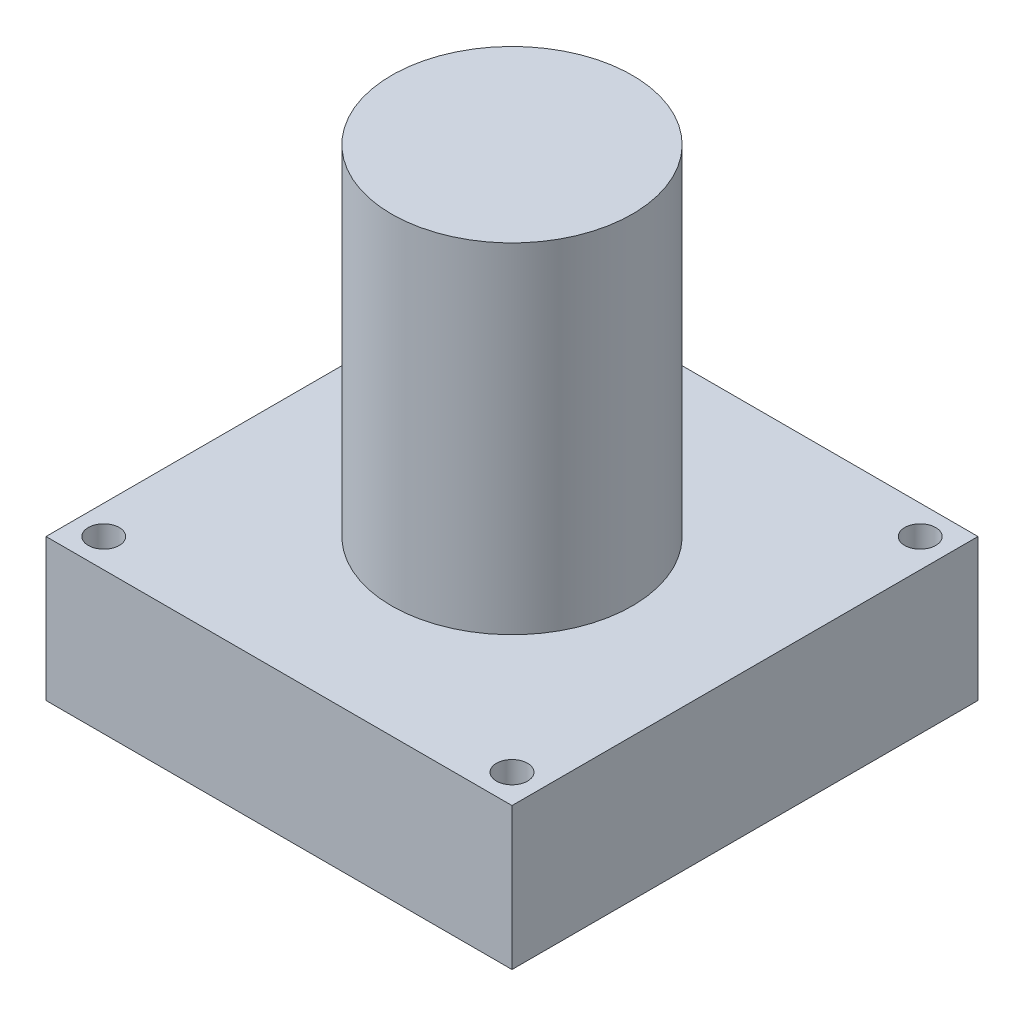
ISO-10303-21;
HEADER;
FILE_DESCRIPTION(('STEP AP214'),'2;1');
FILE_NAME('part.step','',(''),(''),'','','');
FILE_SCHEMA(('AUTOMOTIVE_DESIGN { 1 0 10303 214 1 1 1 1 }'));
ENDSEC;
DATA;
#1=APPLICATION_CONTEXT('core data for automotive mechanical design processes');
#2=APPLICATION_PROTOCOL_DEFINITION('international standard','automotive_design',2000,#1);
#3=PRODUCT_CONTEXT('',#1,'mechanical');
#4=PRODUCT('Part','Part','',(#3));
#5=PRODUCT_RELATED_PRODUCT_CATEGORY('part','',(#4));
#6=PRODUCT_DEFINITION_FORMATION('','',#4);
#7=PRODUCT_DEFINITION_CONTEXT('part definition',#1,'design');
#8=PRODUCT_DEFINITION('design','',#6,#7);
#9=PRODUCT_DEFINITION_SHAPE('','',#8);
#10=(LENGTH_UNIT() NAMED_UNIT(*) SI_UNIT(.MILLI.,.METRE.));
#11=(NAMED_UNIT(*) PLANE_ANGLE_UNIT() SI_UNIT($,.RADIAN.));
#12=(NAMED_UNIT(*) SI_UNIT($,.STERADIAN.) SOLID_ANGLE_UNIT());
#13=UNCERTAINTY_MEASURE_WITH_UNIT(LENGTH_MEASURE(1.E-05),#10,'distance_accuracy_value','');
#14=(GEOMETRIC_REPRESENTATION_CONTEXT(3) GLOBAL_UNCERTAINTY_ASSIGNED_CONTEXT((#13)) GLOBAL_UNIT_ASSIGNED_CONTEXT((#10,
#11,#12)) REPRESENTATION_CONTEXT('',''));
#15=CARTESIAN_POINT('',(0.,0.,0.));
#16=DIRECTION('',(0.,0.,1.));
#17=DIRECTION('',(1.,0.,0.));
#18=AXIS2_PLACEMENT_3D('',#15,#16,#17);
#19=CARTESIAN_POINT('',(0.,0.,0.));
#20=DIRECTION('',(0.,1.,0.));
#21=DIRECTION('',(0.,0.,1.));
#22=AXIS2_PLACEMENT_3D('',#19,#20,#21);
#23=PLANE('',#22);
#24=DIRECTION('',(1.,0.,0.));
#25=VECTOR('',#24,1.);
#26=CARTESIAN_POINT('',(0.,0.,0.));
#27=LINE('',#26,#25);
#28=CARTESIAN_POINT('',(0.,0.,0.));
#29=VERTEX_POINT('',#28);
#30=CARTESIAN_POINT('',(30.,0.,0.));
#31=VERTEX_POINT('',#30);
#32=EDGE_CURVE('E168',#29,#31,#27,.T.);
#33=ORIENTED_EDGE('',*,*,#32,.F.);
#34=DIRECTION('',(0.,0.,-1.));
#35=VECTOR('',#34,1.);
#36=CARTESIAN_POINT('',(0.,0.,0.));
#37=LINE('',#36,#35);
#38=CARTESIAN_POINT('',(0.,0.,-30.));
#39=VERTEX_POINT('',#38);
#40=EDGE_CURVE('E136',#29,#39,#37,.T.);
#41=ORIENTED_EDGE('',*,*,#40,.T.);
#42=DIRECTION('',(1.,0.,0.));
#43=VECTOR('',#42,1.);
#44=CARTESIAN_POINT('',(0.,0.,-30.));
#45=LINE('',#44,#43);
#46=CARTESIAN_POINT('',(30.,0.,-30.));
#47=VERTEX_POINT('',#46);
#48=EDGE_CURVE('E174',#39,#47,#45,.T.);
#49=ORIENTED_EDGE('',*,*,#48,.T.);
#50=DIRECTION('',(0.,0.,-1.));
#51=VECTOR('',#50,1.);
#52=CARTESIAN_POINT('',(30.,0.,0.));
#53=LINE('',#52,#51);
#54=EDGE_CURVE('E171',#31,#47,#53,.T.);
#55=ORIENTED_EDGE('',*,*,#54,.F.);
#56=EDGE_LOOP('',(#33,#41,#49,#55));
#57=FACE_BOUND('',#56,.T.);
#58=CARTESIAN_POINT('',(1.86,0.,-1.86));
#59=DIRECTION('',(0.,1.,0.));
#60=DIRECTION('',(0.,0.,1.));
#61=AXIS2_PLACEMENT_3D('',#58,#59,#60);
#62=CIRCLE('',#61,1.);
#63=CARTESIAN_POINT('',(1.86,0.,-0.86));
#64=VERTEX_POINT('',#63);
#65=EDGE_CURVE('E165',#64,#64,#62,.T.);
#66=ORIENTED_EDGE('',*,*,#65,.T.);
#67=EDGE_LOOP('',(#66));
#68=FACE_BOUND('',#67,.T.);
#69=CARTESIAN_POINT('',(1.86,0.,-28.1400088));
#70=DIRECTION('',(0.,1.,0.));
#71=DIRECTION('',(0.,0.,1.));
#72=AXIS2_PLACEMENT_3D('',#69,#70,#71);
#73=CIRCLE('',#72,1.);
#74=CARTESIAN_POINT('',(1.86,0.,-27.1400088));
#75=VERTEX_POINT('',#74);
#76=EDGE_CURVE('E162',#75,#75,#73,.T.);
#77=ORIENTED_EDGE('',*,*,#76,.T.);
#78=EDGE_LOOP('',(#77));
#79=FACE_BOUND('',#78,.T.);
#80=CARTESIAN_POINT('',(28.14,0.,-28.1400088));
#81=DIRECTION('',(0.,1.,0.));
#82=DIRECTION('',(0.,0.,1.));
#83=AXIS2_PLACEMENT_3D('',#80,#81,#82);
#84=CIRCLE('',#83,1.);
#85=CARTESIAN_POINT('',(28.14,0.,-27.1400088));
#86=VERTEX_POINT('',#85);
#87=EDGE_CURVE('E159',#86,#86,#84,.T.);
#88=ORIENTED_EDGE('',*,*,#87,.T.);
#89=EDGE_LOOP('',(#88));
#90=FACE_BOUND('',#89,.T.);
#91=CARTESIAN_POINT('',(28.14,0.,-1.86));
#92=DIRECTION('',(0.,1.,0.));
#93=DIRECTION('',(0.,0.,1.));
#94=AXIS2_PLACEMENT_3D('',#91,#92,#93);
#95=CIRCLE('',#94,1.);
#96=CARTESIAN_POINT('',(28.14,0.,-0.859999999999999));
#97=VERTEX_POINT('',#96);
#98=EDGE_CURVE('E126',#97,#97,#95,.T.);
#99=ORIENTED_EDGE('',*,*,#98,.T.);
#100=EDGE_LOOP('',(#99));
#101=FACE_BOUND('',#100,.T.);
#102=DIRECTION('',(0.,0.,-1.));
#103=VECTOR('',#102,1.);
#104=CARTESIAN_POINT('',(8.3325,0.,-24.666));
#105=LINE('',#104,#103);
#106=CARTESIAN_POINT('',(8.3325,0.,-24.666));
#107=VERTEX_POINT('',#106);
#108=CARTESIAN_POINT('',(8.3325,0.,-27.714));
#109=VERTEX_POINT('',#108);
#110=EDGE_CURVE('E122',#107,#109,#105,.T.);
#111=ORIENTED_EDGE('',*,*,#110,.F.);
#112=DIRECTION('',(-1.,0.,0.));
#113=VECTOR('',#112,1.);
#114=CARTESIAN_POINT('',(8.3325,0.,-24.666));
#115=LINE('',#114,#113);
#116=CARTESIAN_POINT('',(21.6675,0.,-24.666));
#117=VERTEX_POINT('',#116);
#118=EDGE_CURVE('E119',#117,#107,#115,.T.);
#119=ORIENTED_EDGE('',*,*,#118,.F.);
#120=DIRECTION('',(0.,0.,1.));
#121=VECTOR('',#120,1.);
#122=CARTESIAN_POINT('',(21.6675,0.,-24.666));
#123=LINE('',#122,#121);
#124=CARTESIAN_POINT('',(21.6675,0.,-27.714));
#125=VERTEX_POINT('',#124);
#126=EDGE_CURVE('E57',#125,#117,#123,.T.);
#127=ORIENTED_EDGE('',*,*,#126,.F.);
#128=DIRECTION('',(1.,0.,0.));
#129=VECTOR('',#128,1.);
#130=CARTESIAN_POINT('',(8.3325,0.,-27.714));
#131=LINE('',#130,#129);
#132=EDGE_CURVE('E52',#109,#125,#131,.T.);
#133=ORIENTED_EDGE('',*,*,#132,.F.);
#134=EDGE_LOOP('',(#111,#119,#127,#133));
#135=FACE_BOUND('',#134,.T.);
#136=ADVANCED_FACE('F36',(#57,#68,#79,#90,#101,#135),#23,.F.);
#137=CARTESIAN_POINT('',(0.,9.144,0.));
#138=DIRECTION('',(0.,0.,-1.));
#139=DIRECTION('',(-1.,0.,0.));
#140=AXIS2_PLACEMENT_3D('',#137,#138,#139);
#141=PLANE('',#140);
#142=ORIENTED_EDGE('',*,*,#32,.T.);
#143=DIRECTION('',(0.,-1.,0.));
#144=VECTOR('',#143,1.);
#145=CARTESIAN_POINT('',(30.,9.144,0.));
#146=LINE('',#145,#144);
#147=CARTESIAN_POINT('',(30.,9.144,0.));
#148=VERTEX_POINT('',#147);
#149=EDGE_CURVE('E40',#148,#31,#146,.T.);
#150=ORIENTED_EDGE('',*,*,#149,.F.);
#151=DIRECTION('',(1.,0.,0.));
#152=VECTOR('',#151,1.);
#153=CARTESIAN_POINT('',(0.,9.144,0.));
#154=LINE('',#153,#152);
#155=CARTESIAN_POINT('',(0.,9.144,0.));
#156=VERTEX_POINT('',#155);
#157=EDGE_CURVE('E145',#156,#148,#154,.T.);
#158=ORIENTED_EDGE('',*,*,#157,.F.);
#159=DIRECTION('',(0.,-1.,0.));
#160=VECTOR('',#159,1.);
#161=CARTESIAN_POINT('',(0.,9.144,0.));
#162=LINE('',#161,#160);
#163=EDGE_CURVE('E156',#156,#29,#162,.T.);
#164=ORIENTED_EDGE('',*,*,#163,.T.);
#165=EDGE_LOOP('',(#142,#150,#158,#164));
#166=FACE_BOUND('',#165,.T.);
#167=ADVANCED_FACE('F192',(#166),#141,.F.);
#168=CARTESIAN_POINT('',(30.,9.144,0.));
#169=DIRECTION('',(-1.,0.,0.));
#170=DIRECTION('',(0.,0.,1.));
#171=AXIS2_PLACEMENT_3D('',#168,#169,#170);
#172=PLANE('',#171);
#173=ORIENTED_EDGE('',*,*,#54,.T.);
#174=DIRECTION('',(0.,-1.,0.));
#175=VECTOR('',#174,1.);
#176=CARTESIAN_POINT('',(30.,9.144,-30.));
#177=LINE('',#176,#175);
#178=CARTESIAN_POINT('',(30.,9.144,-30.));
#179=VERTEX_POINT('',#178);
#180=EDGE_CURVE('E181',#179,#47,#177,.T.);
#181=ORIENTED_EDGE('',*,*,#180,.F.);
#182=DIRECTION('',(0.,0.,-1.));
#183=VECTOR('',#182,1.);
#184=CARTESIAN_POINT('',(30.,9.144,0.));
#185=LINE('',#184,#183);
#186=EDGE_CURVE('E148',#148,#179,#185,.T.);
#187=ORIENTED_EDGE('',*,*,#186,.F.);
#188=ORIENTED_EDGE('',*,*,#149,.T.);
#189=EDGE_LOOP('',(#173,#181,#187,#188));
#190=FACE_BOUND('',#189,.T.);
#191=ADVANCED_FACE('F188',(#190),#172,.F.);
#192=CARTESIAN_POINT('',(0.,9.144,-30.));
#193=DIRECTION('',(0.,0.,-1.));
#194=DIRECTION('',(-1.,0.,0.));
#195=AXIS2_PLACEMENT_3D('',#192,#193,#194);
#196=PLANE('',#195);
#197=ORIENTED_EDGE('',*,*,#48,.F.);
#198=DIRECTION('',(0.,-1.,0.));
#199=VECTOR('',#198,1.);
#200=CARTESIAN_POINT('',(0.,9.144,-30.));
#201=LINE('',#200,#199);
#202=CARTESIAN_POINT('',(0.,9.144,-30.));
#203=VERTEX_POINT('',#202);
#204=EDGE_CURVE('E180',#203,#39,#201,.T.);
#205=ORIENTED_EDGE('',*,*,#204,.F.);
#206=DIRECTION('',(1.,0.,0.));
#207=VECTOR('',#206,1.);
#208=CARTESIAN_POINT('',(0.,9.144,-30.));
#209=LINE('',#208,#207);
#210=EDGE_CURVE('E150',#203,#179,#209,.T.);
#211=ORIENTED_EDGE('',*,*,#210,.T.);
#212=ORIENTED_EDGE('',*,*,#180,.T.);
#213=EDGE_LOOP('',(#197,#205,#211,#212));
#214=FACE_BOUND('',#213,.T.);
#215=ADVANCED_FACE('F200',(#214),#196,.T.);
#216=CARTESIAN_POINT('',(1.86,9.144,-1.86));
#217=DIRECTION('',(0.,-1.,0.));
#218=DIRECTION('',(0.,0.,-1.));
#219=AXIS2_PLACEMENT_3D('',#216,#217,#218);
#220=CYLINDRICAL_SURFACE('',#219,1.);
#221=CARTESIAN_POINT('',(1.86,9.144,-1.86));
#222=DIRECTION('',(0.,1.,0.));
#223=DIRECTION('',(0.,0.,1.));
#224=AXIS2_PLACEMENT_3D('',#221,#222,#223);
#225=CIRCLE('',#224,1.);
#226=CARTESIAN_POINT('',(1.86,9.144,-0.86));
#227=VERTEX_POINT('',#226);
#228=EDGE_CURVE('E142',#227,#227,#225,.T.);
#229=ORIENTED_EDGE('',*,*,#228,.T.);
#230=EDGE_LOOP('',(#229));
#231=FACE_BOUND('',#230,.T.);
#232=ORIENTED_EDGE('',*,*,#65,.F.);
#233=EDGE_LOOP('',(#232));
#234=FACE_BOUND('',#233,.T.);
#235=ADVANCED_FACE('F202',(#231,#234),#220,.F.);
#236=CARTESIAN_POINT('',(1.86,9.144,-28.1400088));
#237=DIRECTION('',(0.,-1.,0.));
#238=DIRECTION('',(0.,0.,-1.));
#239=AXIS2_PLACEMENT_3D('',#236,#237,#238);
#240=CYLINDRICAL_SURFACE('',#239,1.);
#241=CARTESIAN_POINT('',(1.86,9.144,-28.1400088));
#242=DIRECTION('',(0.,1.,0.));
#243=DIRECTION('',(0.,0.,1.));
#244=AXIS2_PLACEMENT_3D('',#241,#242,#243);
#245=CIRCLE('',#244,1.);
#246=CARTESIAN_POINT('',(1.86,9.144,-27.1400088));
#247=VERTEX_POINT('',#246);
#248=EDGE_CURVE('E139',#247,#247,#245,.T.);
#249=ORIENTED_EDGE('',*,*,#248,.T.);
#250=EDGE_LOOP('',(#249));
#251=FACE_BOUND('',#250,.T.);
#252=ORIENTED_EDGE('',*,*,#76,.F.);
#253=EDGE_LOOP('',(#252));
#254=FACE_BOUND('',#253,.T.);
#255=ADVANCED_FACE('F208',(#251,#254),#240,.F.);
#256=CARTESIAN_POINT('',(28.14,9.144,-28.1400088));
#257=DIRECTION('',(0.,-1.,0.));
#258=DIRECTION('',(0.,0.,-1.));
#259=AXIS2_PLACEMENT_3D('',#256,#257,#258);
#260=CYLINDRICAL_SURFACE('',#259,1.);
#261=CARTESIAN_POINT('',(28.14,9.144,-28.1400088));
#262=DIRECTION('',(0.,1.,0.));
#263=DIRECTION('',(0.,0.,1.));
#264=AXIS2_PLACEMENT_3D('',#261,#262,#263);
#265=CIRCLE('',#264,1.);
#266=CARTESIAN_POINT('',(28.14,9.144,-27.1400088));
#267=VERTEX_POINT('',#266);
#268=EDGE_CURVE('E135',#267,#267,#265,.T.);
#269=ORIENTED_EDGE('',*,*,#268,.T.);
#270=EDGE_LOOP('',(#269));
#271=FACE_BOUND('',#270,.T.);
#272=ORIENTED_EDGE('',*,*,#87,.F.);
#273=EDGE_LOOP('',(#272));
#274=FACE_BOUND('',#273,.T.);
#275=ADVANCED_FACE('F229',(#271,#274),#260,.F.);
#276=CARTESIAN_POINT('',(28.14,9.144,-1.86));
#277=DIRECTION('',(0.,-1.,0.));
#278=DIRECTION('',(0.,0.,-1.));
#279=AXIS2_PLACEMENT_3D('',#276,#277,#278);
#280=CYLINDRICAL_SURFACE('',#279,1.);
#281=CARTESIAN_POINT('',(28.14,9.144,-1.86));
#282=DIRECTION('',(0.,1.,0.));
#283=DIRECTION('',(0.,0.,1.));
#284=AXIS2_PLACEMENT_3D('',#281,#282,#283);
#285=CIRCLE('',#284,1.);
#286=CARTESIAN_POINT('',(28.14,9.144,-0.859999999999999));
#287=VERTEX_POINT('',#286);
#288=EDGE_CURVE('E132',#287,#287,#285,.T.);
#289=ORIENTED_EDGE('',*,*,#288,.T.);
#290=EDGE_LOOP('',(#289));
#291=FACE_BOUND('',#290,.T.);
#292=ORIENTED_EDGE('',*,*,#98,.F.);
#293=EDGE_LOOP('',(#292));
#294=FACE_BOUND('',#293,.T.);
#295=ADVANCED_FACE('F38',(#291,#294),#280,.F.);
#296=CARTESIAN_POINT('',(0.,9.144,0.));
#297=DIRECTION('',(-1.,0.,0.));
#298=DIRECTION('',(0.,0.,1.));
#299=AXIS2_PLACEMENT_3D('',#296,#297,#298);
#300=PLANE('',#299);
#301=ORIENTED_EDGE('',*,*,#40,.F.);
#302=ORIENTED_EDGE('',*,*,#163,.F.);
#303=DIRECTION('',(0.,0.,-1.));
#304=VECTOR('',#303,1.);
#305=CARTESIAN_POINT('',(0.,9.144,0.));
#306=LINE('',#305,#304);
#307=EDGE_CURVE('E153',#156,#203,#306,.T.);
#308=ORIENTED_EDGE('',*,*,#307,.T.);
#309=ORIENTED_EDGE('',*,*,#204,.T.);
#310=EDGE_LOOP('',(#301,#302,#308,#309));
#311=FACE_BOUND('',#310,.T.);
#312=ADVANCED_FACE('F197',(#311),#300,.T.);
#313=CARTESIAN_POINT('',(0.,9.144,0.));
#314=DIRECTION('',(0.,1.,0.));
#315=DIRECTION('',(0.,0.,1.));
#316=AXIS2_PLACEMENT_3D('',#313,#314,#315);
#317=PLANE('',#316);
#318=CARTESIAN_POINT('',(15.,9.144,-15.));
#319=DIRECTION('',(0.,1.,0.));
#320=DIRECTION('',(0.,0.,1.));
#321=AXIS2_PLACEMENT_3D('',#318,#319,#320);
#322=CIRCLE('',#321,7.747);
#323=CARTESIAN_POINT('',(15.,9.144,-7.253));
#324=VERTEX_POINT('',#323);
#325=EDGE_CURVE('E11',#324,#324,#322,.T.);
#326=ORIENTED_EDGE('',*,*,#325,.F.);
#327=EDGE_LOOP('',(#326));
#328=FACE_BOUND('',#327,.T.);
#329=ORIENTED_EDGE('',*,*,#288,.F.);
#330=EDGE_LOOP('',(#329));
#331=FACE_BOUND('',#330,.T.);
#332=ORIENTED_EDGE('',*,*,#268,.F.);
#333=EDGE_LOOP('',(#332));
#334=FACE_BOUND('',#333,.T.);
#335=ORIENTED_EDGE('',*,*,#248,.F.);
#336=EDGE_LOOP('',(#335));
#337=FACE_BOUND('',#336,.T.);
#338=ORIENTED_EDGE('',*,*,#228,.F.);
#339=EDGE_LOOP('',(#338));
#340=FACE_BOUND('',#339,.T.);
#341=ORIENTED_EDGE('',*,*,#157,.T.);
#342=ORIENTED_EDGE('',*,*,#186,.T.);
#343=ORIENTED_EDGE('',*,*,#210,.F.);
#344=ORIENTED_EDGE('',*,*,#307,.F.);
#345=EDGE_LOOP('',(#341,#342,#343,#344));
#346=FACE_BOUND('',#345,.T.);
#347=ADVANCED_FACE('F220',(#328,#331,#334,#337,#340,#346),#317,.T.);
#348=CARTESIAN_POINT('',(15.,30.988,-15.));
#349=DIRECTION('',(0.,-1.,0.));
#350=DIRECTION('',(0.,0.,-1.));
#351=AXIS2_PLACEMENT_3D('',#348,#349,#350);
#352=CYLINDRICAL_SURFACE('',#351,7.747);
#353=CARTESIAN_POINT('',(15.,30.988,-15.));
#354=DIRECTION('',(0.,1.,0.));
#355=DIRECTION('',(0.,0.,1.));
#356=AXIS2_PLACEMENT_3D('',#353,#354,#355);
#357=CIRCLE('',#356,7.747);
#358=CARTESIAN_POINT('',(15.,30.988,-7.253));
#359=VERTEX_POINT('',#358);
#360=EDGE_CURVE('E123',#359,#359,#357,.T.);
#361=ORIENTED_EDGE('',*,*,#360,.F.);
#362=EDGE_LOOP('',(#361));
#363=FACE_BOUND('',#362,.T.);
#364=ORIENTED_EDGE('',*,*,#325,.T.);
#365=EDGE_LOOP('',(#364));
#366=FACE_BOUND('',#365,.T.);
#367=ADVANCED_FACE('F227',(#363,#366),#352,.T.);
#368=CARTESIAN_POINT('',(15.,30.988,-15.));
#369=DIRECTION('',(0.,1.,0.));
#370=DIRECTION('',(0.,0.,1.));
#371=AXIS2_PLACEMENT_3D('',#368,#369,#370);
#372=PLANE('',#371);
#373=ORIENTED_EDGE('',*,*,#360,.T.);
#374=EDGE_LOOP('',(#373));
#375=FACE_BOUND('',#374,.T.);
#376=ADVANCED_FACE('F266',(#375),#372,.T.);
#377=CARTESIAN_POINT('',(8.3325,-6.35,-24.666));
#378=DIRECTION('',(1.,0.,0.));
#379=DIRECTION('',(0.,0.,-1.));
#380=AXIS2_PLACEMENT_3D('',#377,#378,#379);
#381=PLANE('',#380);
#382=ORIENTED_EDGE('',*,*,#110,.T.);
#383=DIRECTION('',(0.,1.,0.));
#384=VECTOR('',#383,1.);
#385=CARTESIAN_POINT('',(8.3325,-6.35,-27.714));
#386=LINE('',#385,#384);
#387=CARTESIAN_POINT('',(8.3325,-6.35,-27.714));
#388=VERTEX_POINT('',#387);
#389=EDGE_CURVE('E103',#388,#109,#386,.T.);
#390=ORIENTED_EDGE('',*,*,#389,.F.);
#391=DIRECTION('',(0.,0.,-1.));
#392=VECTOR('',#391,1.);
#393=CARTESIAN_POINT('',(8.3325,-6.35,-24.666));
#394=LINE('',#393,#392);
#395=CARTESIAN_POINT('',(8.3325,-6.35,-24.666));
#396=VERTEX_POINT('',#395);
#397=EDGE_CURVE('E110',#396,#388,#394,.T.);
#398=ORIENTED_EDGE('',*,*,#397,.F.);
#399=DIRECTION('',(0.,1.,0.));
#400=VECTOR('',#399,1.);
#401=CARTESIAN_POINT('',(8.3325,-6.35,-24.666));
#402=LINE('',#401,#400);
#403=EDGE_CURVE('E244',#396,#107,#402,.T.);
#404=ORIENTED_EDGE('',*,*,#403,.T.);
#405=EDGE_LOOP('',(#382,#390,#398,#404));
#406=FACE_BOUND('',#405,.T.);
#407=ADVANCED_FACE('F121',(#406),#381,.F.);
#408=CARTESIAN_POINT('',(8.3325,-6.35,-27.714));
#409=DIRECTION('',(0.,0.,1.));
#410=DIRECTION('',(1.,0.,0.));
#411=AXIS2_PLACEMENT_3D('',#408,#409,#410);
#412=PLANE('',#411);
#413=ORIENTED_EDGE('',*,*,#132,.T.);
#414=DIRECTION('',(0.,1.,0.));
#415=VECTOR('',#414,1.);
#416=CARTESIAN_POINT('',(21.6675,-6.35,-27.714));
#417=LINE('',#416,#415);
#418=CARTESIAN_POINT('',(21.6675,-6.35,-27.714));
#419=VERTEX_POINT('',#418);
#420=EDGE_CURVE('E106',#419,#125,#417,.T.);
#421=ORIENTED_EDGE('',*,*,#420,.F.);
#422=DIRECTION('',(1.,0.,0.));
#423=VECTOR('',#422,1.);
#424=CARTESIAN_POINT('',(8.3325,-6.35,-27.714));
#425=LINE('',#424,#423);
#426=EDGE_CURVE('E99',#388,#419,#425,.T.);
#427=ORIENTED_EDGE('',*,*,#426,.F.);
#428=ORIENTED_EDGE('',*,*,#389,.T.);
#429=EDGE_LOOP('',(#413,#421,#427,#428));
#430=FACE_BOUND('',#429,.T.);
#431=ADVANCED_FACE('F101',(#430),#412,.F.);
#432=CARTESIAN_POINT('',(21.6675,-6.35,-24.666));
#433=DIRECTION('',(-1.,0.,0.));
#434=DIRECTION('',(0.,0.,1.));
#435=AXIS2_PLACEMENT_3D('',#432,#433,#434);
#436=PLANE('',#435);
#437=ORIENTED_EDGE('',*,*,#126,.T.);
#438=DIRECTION('',(0.,1.,0.));
#439=VECTOR('',#438,1.);
#440=CARTESIAN_POINT('',(21.6675,-6.35,-24.666));
#441=LINE('',#440,#439);
#442=CARTESIAN_POINT('',(21.6675,-6.35,-24.666));
#443=VERTEX_POINT('',#442);
#444=EDGE_CURVE('E128',#443,#117,#441,.T.);
#445=ORIENTED_EDGE('',*,*,#444,.F.);
#446=DIRECTION('',(0.,0.,1.));
#447=VECTOR('',#446,1.);
#448=CARTESIAN_POINT('',(21.6675,-6.35,-24.666));
#449=LINE('',#448,#447);
#450=EDGE_CURVE('E109',#419,#443,#449,.T.);
#451=ORIENTED_EDGE('',*,*,#450,.F.);
#452=ORIENTED_EDGE('',*,*,#420,.T.);
#453=EDGE_LOOP('',(#437,#445,#451,#452));
#454=FACE_BOUND('',#453,.T.);
#455=ADVANCED_FACE('F253',(#454),#436,.F.);
#456=CARTESIAN_POINT('',(8.3325,-6.35,-24.666));
#457=DIRECTION('',(0.,0.,-1.));
#458=DIRECTION('',(-1.,0.,0.));
#459=AXIS2_PLACEMENT_3D('',#456,#457,#458);
#460=PLANE('',#459);
#461=ORIENTED_EDGE('',*,*,#118,.T.);
#462=ORIENTED_EDGE('',*,*,#403,.F.);
#463=DIRECTION('',(-1.,0.,0.));
#464=VECTOR('',#463,1.);
#465=CARTESIAN_POINT('',(8.3325,-6.35,-24.666));
#466=LINE('',#465,#464);
#467=EDGE_CURVE('E115',#443,#396,#466,.T.);
#468=ORIENTED_EDGE('',*,*,#467,.F.);
#469=ORIENTED_EDGE('',*,*,#444,.T.);
#470=EDGE_LOOP('',(#461,#462,#468,#469));
#471=FACE_BOUND('',#470,.T.);
#472=ADVANCED_FACE('F243',(#471),#460,.F.);
#473=CARTESIAN_POINT('',(0.,-6.35,0.));
#474=DIRECTION('',(0.,-1.,0.));
#475=DIRECTION('',(0.,0.,-1.));
#476=AXIS2_PLACEMENT_3D('',#473,#474,#475);
#477=PLANE('',#476);
#478=ORIENTED_EDGE('',*,*,#397,.T.);
#479=ORIENTED_EDGE('',*,*,#426,.T.);
#480=ORIENTED_EDGE('',*,*,#450,.T.);
#481=ORIENTED_EDGE('',*,*,#467,.T.);
#482=EDGE_LOOP('',(#478,#479,#480,#481));
#483=FACE_BOUND('',#482,.T.);
#484=ADVANCED_FACE('F113',(#483),#477,.T.);
#485=CLOSED_SHELL('',(#136,#167,#191,#215,#235,#255,#275,#295,#312,#347,#367,#376,#407,#431,
#455,#472,#484));
#486=MANIFOLD_SOLID_BREP('B2',#485);
#487=ADVANCED_BREP_SHAPE_REPRESENTATION('',(#18,#486),#14);
#488=SHAPE_DEFINITION_REPRESENTATION(#9,#487);
ENDSEC;
END-ISO-10303-21;
